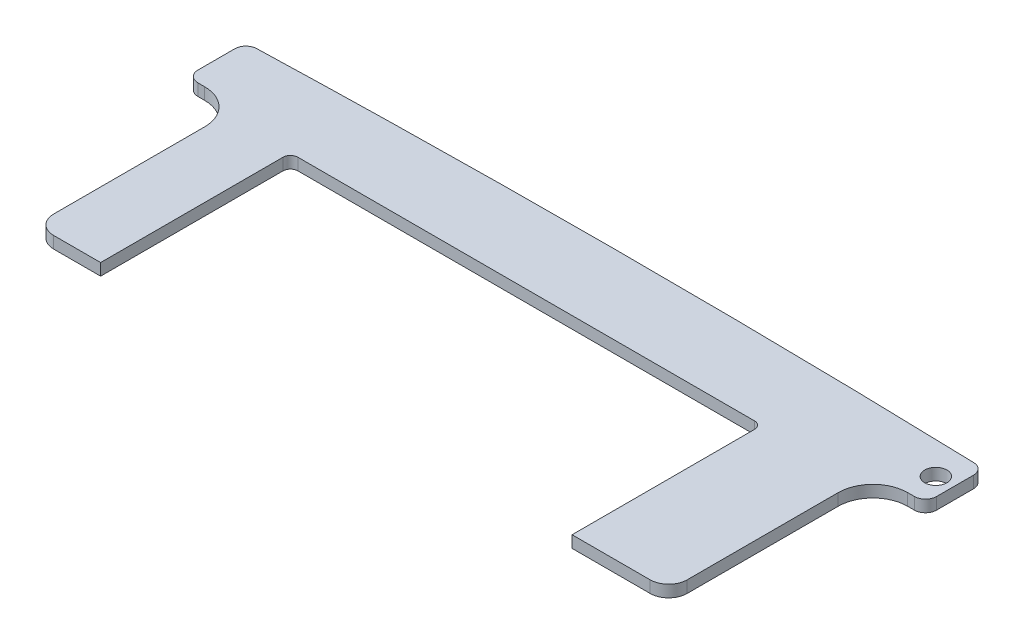
ISO-10303-21;
HEADER;
FILE_DESCRIPTION(('STEP AP214'),'2;1');
FILE_NAME('part.step','',(''),(''),'','','');
FILE_SCHEMA(('AUTOMOTIVE_DESIGN { 1 0 10303 214 1 1 1 1 }'));
ENDSEC;
DATA;
#1=APPLICATION_CONTEXT('core data for automotive mechanical design processes');
#2=APPLICATION_PROTOCOL_DEFINITION('international standard','automotive_design',2000,#1);
#3=PRODUCT_CONTEXT('',#1,'mechanical');
#4=PRODUCT('Part','Part','',(#3));
#5=PRODUCT_RELATED_PRODUCT_CATEGORY('part','',(#4));
#6=PRODUCT_DEFINITION_FORMATION('','',#4);
#7=PRODUCT_DEFINITION_CONTEXT('part definition',#1,'design');
#8=PRODUCT_DEFINITION('design','',#6,#7);
#9=PRODUCT_DEFINITION_SHAPE('','',#8);
#10=(LENGTH_UNIT() NAMED_UNIT(*) SI_UNIT(.MILLI.,.METRE.));
#11=(NAMED_UNIT(*) PLANE_ANGLE_UNIT() SI_UNIT($,.RADIAN.));
#12=(NAMED_UNIT(*) SI_UNIT($,.STERADIAN.) SOLID_ANGLE_UNIT());
#13=UNCERTAINTY_MEASURE_WITH_UNIT(LENGTH_MEASURE(1.E-05),#10,'distance_accuracy_value','');
#14=(GEOMETRIC_REPRESENTATION_CONTEXT(3) GLOBAL_UNCERTAINTY_ASSIGNED_CONTEXT((#13)) GLOBAL_UNIT_ASSIGNED_CONTEXT((#10,
#11,#12)) REPRESENTATION_CONTEXT('',''));
#15=CARTESIAN_POINT('',(0.,0.,0.));
#16=DIRECTION('',(0.,0.,1.));
#17=DIRECTION('',(1.,0.,0.));
#18=AXIS2_PLACEMENT_3D('',#15,#16,#17);
#19=CARTESIAN_POINT('',(0.899999999999838,1.6,2.30000000000011));
#20=DIRECTION('',(0.,-1.,0.));
#21=DIRECTION('',(0.,0.,-1.));
#22=AXIS2_PLACEMENT_3D('',#19,#20,#21);
#23=CYLINDRICAL_SURFACE('',#22,1.5);
#24=CARTESIAN_POINT('',(0.899999999999838,0.,2.30000000000011));
#25=DIRECTION('',(0.,1.,0.));
#26=DIRECTION('',(0.,0.,1.));
#27=AXIS2_PLACEMENT_3D('',#24,#25,#26);
#28=CIRCLE('',#27,1.5);
#29=CARTESIAN_POINT('',(0.899999999999838,0.,3.80000000000011));
#30=VERTEX_POINT('',#29);
#31=CARTESIAN_POINT('',(2.39999999999984,0.,2.30000000000011));
#32=VERTEX_POINT('',#31);
#33=EDGE_CURVE('E206',#30,#32,#28,.T.);
#34=ORIENTED_EDGE('',*,*,#33,.T.);
#35=DIRECTION('',(0.,-1.,0.));
#36=VECTOR('',#35,1.);
#37=CARTESIAN_POINT('',(2.39999999999984,1.6,2.30000000000011));
#38=LINE('',#37,#36);
#39=CARTESIAN_POINT('',(2.39999999999984,1.6,2.30000000000011));
#40=VERTEX_POINT('',#39);
#41=EDGE_CURVE('E186',#40,#32,#38,.T.);
#42=ORIENTED_EDGE('',*,*,#41,.F.);
#43=CARTESIAN_POINT('',(0.899999999999838,1.6,2.30000000000011));
#44=DIRECTION('',(0.,1.,0.));
#45=DIRECTION('',(0.,0.,1.));
#46=AXIS2_PLACEMENT_3D('',#43,#44,#45);
#47=CIRCLE('',#46,1.5);
#48=CARTESIAN_POINT('',(0.899999999999838,1.6,3.80000000000011));
#49=VERTEX_POINT('',#48);
#50=EDGE_CURVE('E193',#49,#40,#47,.T.);
#51=ORIENTED_EDGE('',*,*,#50,.F.);
#52=DIRECTION('',(0.,-1.,0.));
#53=VECTOR('',#52,1.);
#54=CARTESIAN_POINT('',(0.899999999999838,1.6,3.80000000000011));
#55=LINE('',#54,#53);
#56=EDGE_CURVE('E276',#49,#30,#55,.T.);
#57=ORIENTED_EDGE('',*,*,#56,.T.);
#58=EDGE_LOOP('',(#34,#42,#51,#57));
#59=FACE_BOUND('',#58,.T.);
#60=ADVANCED_FACE('F35',(#59),#23,.T.);
#61=CARTESIAN_POINT('',(2.39999999999984,1.6,0.));
#62=DIRECTION('',(-1.,0.,0.));
#63=DIRECTION('',(0.,0.,1.));
#64=AXIS2_PLACEMENT_3D('',#61,#62,#63);
#65=PLANE('',#64);
#66=DIRECTION('',(0.,0.,-1.));
#67=VECTOR('',#66,1.);
#68=CARTESIAN_POINT('',(2.39999999999984,0.,0.));
#69=LINE('',#68,#67);
#70=CARTESIAN_POINT('',(2.39999999999984,0.,-2.67635027045199));
#71=VERTEX_POINT('',#70);
#72=EDGE_CURVE('E326',#32,#71,#69,.T.);
#73=ORIENTED_EDGE('',*,*,#72,.T.);
#74=DIRECTION('',(0.,-1.,0.));
#75=VECTOR('',#74,1.);
#76=CARTESIAN_POINT('',(2.39999999999984,1.6,-2.67635027045199));
#77=LINE('',#76,#75);
#78=CARTESIAN_POINT('',(2.39999999999984,1.6,-2.67635027045199));
#79=VERTEX_POINT('',#78);
#80=EDGE_CURVE('E189',#79,#71,#77,.T.);
#81=ORIENTED_EDGE('',*,*,#80,.F.);
#82=DIRECTION('',(0.,0.,-1.));
#83=VECTOR('',#82,1.);
#84=CARTESIAN_POINT('',(2.39999999999984,1.6,0.));
#85=LINE('',#84,#83);
#86=EDGE_CURVE('E182',#40,#79,#85,.T.);
#87=ORIENTED_EDGE('',*,*,#86,.F.);
#88=ORIENTED_EDGE('',*,*,#41,.T.);
#89=EDGE_LOOP('',(#73,#81,#87,#88));
#90=FACE_BOUND('',#89,.T.);
#91=ADVANCED_FACE('F184',(#90),#65,.F.);
#92=CARTESIAN_POINT('',(0.899999999999838,1.6,-2.67635027045199));
#93=DIRECTION('',(0.,-1.,0.));
#94=DIRECTION('',(0.,0.,-1.));
#95=AXIS2_PLACEMENT_3D('',#92,#93,#94);
#96=CYLINDRICAL_SURFACE('',#95,1.5);
#97=CARTESIAN_POINT('',(0.899999999999838,0.,-2.67635027045199));
#98=DIRECTION('',(0.,1.,0.));
#99=DIRECTION('',(0.,0.,1.));
#100=AXIS2_PLACEMENT_3D('',#97,#98,#99);
#101=CIRCLE('',#100,1.5);
#102=CARTESIAN_POINT('',(0.945019779821518,0.,-4.17567452471616));
#103=VERTEX_POINT('',#102);
#104=EDGE_CURVE('E319',#71,#103,#101,.T.);
#105=ORIENTED_EDGE('',*,*,#104,.T.);
#106=DIRECTION('',(0.,-1.,0.));
#107=VECTOR('',#106,1.);
#108=CARTESIAN_POINT('',(0.945019779821518,1.6,-4.17567452471616));
#109=LINE('',#108,#107);
#110=CARTESIAN_POINT('',(0.945019779821518,1.6,-4.17567452471616));
#111=VERTEX_POINT('',#110);
#112=EDGE_CURVE('E212',#111,#103,#109,.T.);
#113=ORIENTED_EDGE('',*,*,#112,.F.);
#114=CARTESIAN_POINT('',(0.899999999999838,1.6,-2.67635027045199));
#115=DIRECTION('',(0.,1.,0.));
#116=DIRECTION('',(0.,0.,1.));
#117=AXIS2_PLACEMENT_3D('',#114,#115,#116);
#118=CIRCLE('',#117,1.5);
#119=EDGE_CURVE('E192',#79,#111,#118,.T.);
#120=ORIENTED_EDGE('',*,*,#119,.F.);
#121=ORIENTED_EDGE('',*,*,#80,.T.);
#122=EDGE_LOOP('',(#105,#113,#120,#121));
#123=FACE_BOUND('',#122,.T.);
#124=ADVANCED_FACE('F421',(#123),#96,.T.);
#125=CARTESIAN_POINT('',(-47.5000000000002,1.6,49.6315409627609));
#126=DIRECTION('',(0.,1.,0.));
#127=DIRECTION('',(-1.,0.,0.));
#128=AXIS2_PLACEMENT_3D('',#125,#126,#127);
#129=ELLIPSE('',#128,298.595610235777,54.5296875190183);
#130=DIRECTION('',(0.,-1.,0.));
#131=VECTOR('',#130,1.);
#132=SURFACE_OF_LINEAR_EXTRUSION('',#129,#131);
#133=CARTESIAN_POINT('',(-47.5000000000002,0.,49.6315409627609));
#134=DIRECTION('',(0.,1.,0.));
#135=DIRECTION('',(-1.,0.,0.));
#136=AXIS2_PLACEMENT_3D('',#133,#134,#135);
#137=ELLIPSE('',#136,298.595610235777,54.5296875190183);
#138=CARTESIAN_POINT('',(-95.9450197798218,0.,-4.17567452471616));
#139=VERTEX_POINT('',#138);
#140=EDGE_CURVE('E314',#103,#139,#137,.T.);
#141=ORIENTED_EDGE('',*,*,#140,.T.);
#142=DIRECTION('',(0.,-1.,0.));
#143=VECTOR('',#142,1.);
#144=CARTESIAN_POINT('',(-95.9450197798218,1.6,-4.17567452471616));
#145=LINE('',#144,#143);
#146=CARTESIAN_POINT('',(-95.9450197798218,1.6,-4.17567452471616));
#147=VERTEX_POINT('',#146);
#148=EDGE_CURVE('E305',#147,#139,#145,.T.);
#149=ORIENTED_EDGE('',*,*,#148,.F.);
#150=EDGE_CURVE('E316',#111,#147,#129,.T.);
#151=ORIENTED_EDGE('',*,*,#150,.F.);
#152=ORIENTED_EDGE('',*,*,#112,.T.);
#153=EDGE_LOOP('',(#141,#149,#151,#152));
#154=FACE_BOUND('',#153,.T.);
#155=ADVANCED_FACE('F312',(#154),#132,.F.);
#156=CARTESIAN_POINT('',(-95.9000000000001,1.6,-2.67635027045199));
#157=DIRECTION('',(0.,-1.,0.));
#158=DIRECTION('',(0.,0.,-1.));
#159=AXIS2_PLACEMENT_3D('',#156,#157,#158);
#160=CYLINDRICAL_SURFACE('',#159,1.5);
#161=CARTESIAN_POINT('',(-95.9000000000001,0.,-2.67635027045199));
#162=DIRECTION('',(0.,1.,0.));
#163=DIRECTION('',(0.,0.,1.));
#164=AXIS2_PLACEMENT_3D('',#161,#162,#163);
#165=CIRCLE('',#164,1.5);
#166=CARTESIAN_POINT('',(-97.4000000000001,0.,-2.67635027045199));
#167=VERTEX_POINT('',#166);
#168=EDGE_CURVE('E322',#167,#139,#165,.F.);
#169=ORIENTED_EDGE('',*,*,#168,.F.);
#170=DIRECTION('',(0.,-1.,0.));
#171=VECTOR('',#170,1.);
#172=CARTESIAN_POINT('',(-97.4000000000001,1.6,-2.67635027045199));
#173=LINE('',#172,#171);
#174=CARTESIAN_POINT('',(-97.4000000000001,1.6,-2.67635027045199));
#175=VERTEX_POINT('',#174);
#176=EDGE_CURVE('E303',#175,#167,#173,.T.);
#177=ORIENTED_EDGE('',*,*,#176,.F.);
#178=CARTESIAN_POINT('',(-95.9000000000001,1.6,-2.67635027045199));
#179=DIRECTION('',(0.,1.,0.));
#180=DIRECTION('',(0.,0.,1.));
#181=AXIS2_PLACEMENT_3D('',#178,#179,#180);
#182=CIRCLE('',#181,1.5);
#183=EDGE_CURVE('E389',#175,#147,#182,.F.);
#184=ORIENTED_EDGE('',*,*,#183,.T.);
#185=ORIENTED_EDGE('',*,*,#148,.T.);
#186=EDGE_LOOP('',(#169,#177,#184,#185));
#187=FACE_BOUND('',#186,.T.);
#188=ADVANCED_FACE('F385',(#187),#160,.T.);
#189=CARTESIAN_POINT('',(-97.4000000000001,1.6,0.));
#190=DIRECTION('',(1.,0.,0.));
#191=DIRECTION('',(0.,0.,-1.));
#192=AXIS2_PLACEMENT_3D('',#189,#190,#191);
#193=PLANE('',#192);
#194=DIRECTION('',(0.,0.,1.));
#195=VECTOR('',#194,1.);
#196=CARTESIAN_POINT('',(-97.4000000000001,0.,0.));
#197=LINE('',#196,#195);
#198=CARTESIAN_POINT('',(-97.4000000000001,0.,2.30000000000011));
#199=VERTEX_POINT('',#198);
#200=EDGE_CURVE('E324',#167,#199,#197,.T.);
#201=ORIENTED_EDGE('',*,*,#200,.T.);
#202=DIRECTION('',(0.,-1.,0.));
#203=VECTOR('',#202,1.);
#204=CARTESIAN_POINT('',(-97.4000000000001,1.6,2.30000000000011));
#205=LINE('',#204,#203);
#206=CARTESIAN_POINT('',(-97.4000000000001,1.6,2.30000000000011));
#207=VERTEX_POINT('',#206);
#208=EDGE_CURVE('E301',#207,#199,#205,.T.);
#209=ORIENTED_EDGE('',*,*,#208,.F.);
#210=DIRECTION('',(0.,0.,1.));
#211=VECTOR('',#210,1.);
#212=CARTESIAN_POINT('',(-97.4000000000001,1.6,0.));
#213=LINE('',#212,#211);
#214=EDGE_CURVE('E390',#175,#207,#213,.T.);
#215=ORIENTED_EDGE('',*,*,#214,.F.);
#216=ORIENTED_EDGE('',*,*,#176,.T.);
#217=EDGE_LOOP('',(#201,#209,#215,#216));
#218=FACE_BOUND('',#217,.T.);
#219=ADVANCED_FACE('F489',(#218),#193,.F.);
#220=CARTESIAN_POINT('',(-95.9000000000001,1.6,2.30000000000011));
#221=DIRECTION('',(0.,-1.,0.));
#222=DIRECTION('',(0.,0.,-1.));
#223=AXIS2_PLACEMENT_3D('',#220,#221,#222);
#224=CYLINDRICAL_SURFACE('',#223,1.5);
#225=CARTESIAN_POINT('',(-95.9000000000001,0.,2.30000000000011));
#226=DIRECTION('',(0.,1.,0.));
#227=DIRECTION('',(0.,0.,1.));
#228=AXIS2_PLACEMENT_3D('',#225,#226,#227);
#229=CIRCLE('',#228,1.5);
#230=CARTESIAN_POINT('',(-95.9000000000001,0.,3.80000000000011));
#231=VERTEX_POINT('',#230);
#232=EDGE_CURVE('E332',#231,#199,#229,.F.);
#233=ORIENTED_EDGE('',*,*,#232,.F.);
#234=DIRECTION('',(0.,-1.,0.));
#235=VECTOR('',#234,1.);
#236=CARTESIAN_POINT('',(-95.9000000000001,1.6,3.80000000000011));
#237=LINE('',#236,#235);
#238=CARTESIAN_POINT('',(-95.9000000000001,1.6,3.80000000000011));
#239=VERTEX_POINT('',#238);
#240=EDGE_CURVE('E299',#239,#231,#237,.T.);
#241=ORIENTED_EDGE('',*,*,#240,.F.);
#242=CARTESIAN_POINT('',(-95.9000000000001,1.6,2.30000000000011));
#243=DIRECTION('',(0.,1.,0.));
#244=DIRECTION('',(0.,0.,1.));
#245=AXIS2_PLACEMENT_3D('',#242,#243,#244);
#246=CIRCLE('',#245,1.5);
#247=EDGE_CURVE('E392',#239,#207,#246,.F.);
#248=ORIENTED_EDGE('',*,*,#247,.T.);
#249=ORIENTED_EDGE('',*,*,#208,.T.);
#250=EDGE_LOOP('',(#233,#241,#248,#249));
#251=FACE_BOUND('',#250,.T.);
#252=ADVANCED_FACE('F381',(#251),#224,.T.);
#253=CARTESIAN_POINT('',(0.,1.6,3.80000000000007));
#254=DIRECTION('',(0.,0.,1.));
#255=DIRECTION('',(1.,0.,0.));
#256=AXIS2_PLACEMENT_3D('',#253,#254,#255);
#257=PLANE('',#256);
#258=DIRECTION('',(-1.,0.,0.));
#259=VECTOR('',#258,1.);
#260=CARTESIAN_POINT('',(0.,0.,3.80000000000007));
#261=LINE('',#260,#259);
#262=CARTESIAN_POINT('',(-94.9999999999981,0.,3.80000000000011));
#263=VERTEX_POINT('',#262);
#264=EDGE_CURVE('E335',#263,#231,#261,.T.);
#265=ORIENTED_EDGE('',*,*,#264,.F.);
#266=DIRECTION('',(0.,-1.,0.));
#267=VECTOR('',#266,1.);
#268=CARTESIAN_POINT('',(-94.9999999999981,1.6,3.80000000000011));
#269=LINE('',#268,#267);
#270=CARTESIAN_POINT('',(-94.9999999999981,1.6,3.80000000000011));
#271=VERTEX_POINT('',#270);
#272=EDGE_CURVE('E297',#271,#263,#269,.T.);
#273=ORIENTED_EDGE('',*,*,#272,.F.);
#274=DIRECTION('',(-1.,0.,0.));
#275=VECTOR('',#274,1.);
#276=CARTESIAN_POINT('',(0.,1.6,3.80000000000007));
#277=LINE('',#276,#275);
#278=EDGE_CURVE('E377',#271,#239,#277,.T.);
#279=ORIENTED_EDGE('',*,*,#278,.T.);
#280=ORIENTED_EDGE('',*,*,#240,.T.);
#281=EDGE_LOOP('',(#265,#273,#279,#280));
#282=FACE_BOUND('',#281,.T.);
#283=ADVANCED_FACE('F375',(#282),#257,.T.);
#284=CARTESIAN_POINT('',(-94.9999999999981,1.6,8.5000000000001));
#285=DIRECTION('',(0.,-1.,0.));
#286=DIRECTION('',(0.,0.,-1.));
#287=AXIS2_PLACEMENT_3D('',#284,#285,#286);
#288=CYLINDRICAL_SURFACE('',#287,4.70000000000003);
#289=CARTESIAN_POINT('',(-94.9999999999981,0.,8.5000000000001));
#290=DIRECTION('',(0.,1.,0.));
#291=DIRECTION('',(0.,0.,1.));
#292=AXIS2_PLACEMENT_3D('',#289,#290,#291);
#293=CIRCLE('',#292,4.70000000000003);
#294=CARTESIAN_POINT('',(-90.299999999998,0.,8.5000000000001));
#295=VERTEX_POINT('',#294);
#296=EDGE_CURVE('E338',#295,#263,#293,.T.);
#297=ORIENTED_EDGE('',*,*,#296,.F.);
#298=DIRECTION('',(0.,-1.,0.));
#299=VECTOR('',#298,1.);
#300=CARTESIAN_POINT('',(-90.299999999998,1.6,8.5000000000001));
#301=LINE('',#300,#299);
#302=CARTESIAN_POINT('',(-90.299999999998,1.6,8.5000000000001));
#303=VERTEX_POINT('',#302);
#304=EDGE_CURVE('E295',#303,#295,#301,.T.);
#305=ORIENTED_EDGE('',*,*,#304,.F.);
#306=CARTESIAN_POINT('',(-94.9999999999981,1.6,8.5000000000001));
#307=DIRECTION('',(0.,1.,0.));
#308=DIRECTION('',(0.,0.,1.));
#309=AXIS2_PLACEMENT_3D('',#306,#307,#308);
#310=CIRCLE('',#309,4.70000000000003);
#311=EDGE_CURVE('E371',#303,#271,#310,.T.);
#312=ORIENTED_EDGE('',*,*,#311,.T.);
#313=ORIENTED_EDGE('',*,*,#272,.T.);
#314=EDGE_LOOP('',(#297,#305,#312,#313));
#315=FACE_BOUND('',#314,.T.);
#316=ADVANCED_FACE('F368',(#315),#288,.F.);
#317=CARTESIAN_POINT('',(-90.299999999998,1.6,0.));
#318=DIRECTION('',(-1.,0.,0.));
#319=DIRECTION('',(0.,0.,1.));
#320=AXIS2_PLACEMENT_3D('',#317,#318,#319);
#321=PLANE('',#320);
#322=DIRECTION('',(0.,0.,-1.));
#323=VECTOR('',#322,1.);
#324=CARTESIAN_POINT('',(-90.299999999998,0.,0.));
#325=LINE('',#324,#323);
#326=CARTESIAN_POINT('',(-90.299999999998,0.,28.9018534437427));
#327=VERTEX_POINT('',#326);
#328=EDGE_CURVE('E341',#327,#295,#325,.T.);
#329=ORIENTED_EDGE('',*,*,#328,.F.);
#330=DIRECTION('',(0.,-1.,0.));
#331=VECTOR('',#330,1.);
#332=CARTESIAN_POINT('',(-90.299999999998,1.6,28.9018534437427));
#333=LINE('',#332,#331);
#334=CARTESIAN_POINT('',(-90.299999999998,1.6,28.9018534437427));
#335=VERTEX_POINT('',#334);
#336=EDGE_CURVE('E293',#335,#327,#333,.T.);
#337=ORIENTED_EDGE('',*,*,#336,.F.);
#338=DIRECTION('',(0.,0.,-1.));
#339=VECTOR('',#338,1.);
#340=CARTESIAN_POINT('',(-90.299999999998,1.6,0.));
#341=LINE('',#340,#339);
#342=EDGE_CURVE('E401',#335,#303,#341,.T.);
#343=ORIENTED_EDGE('',*,*,#342,.T.);
#344=ORIENTED_EDGE('',*,*,#304,.T.);
#345=EDGE_LOOP('',(#329,#337,#343,#344));
#346=FACE_BOUND('',#345,.T.);
#347=ADVANCED_FACE('F364',(#346),#321,.T.);
#348=CARTESIAN_POINT('',(-87.799999999998,1.6,28.9018534437427));
#349=DIRECTION('',(0.,-1.,0.));
#350=DIRECTION('',(0.,0.,-1.));
#351=AXIS2_PLACEMENT_3D('',#348,#349,#350);
#352=CYLINDRICAL_SURFACE('',#351,2.49999999999999);
#353=CARTESIAN_POINT('',(-87.799999999998,0.,28.9018534437427));
#354=DIRECTION('',(0.,1.,0.));
#355=DIRECTION('',(0.,0.,1.));
#356=AXIS2_PLACEMENT_3D('',#353,#354,#355);
#357=CIRCLE('',#356,2.49999999999999);
#358=CARTESIAN_POINT('',(-87.799999999998,0.,31.4018534437427));
#359=VERTEX_POINT('',#358);
#360=EDGE_CURVE('E344',#359,#327,#357,.F.);
#361=ORIENTED_EDGE('',*,*,#360,.F.);
#362=DIRECTION('',(0.,-1.,0.));
#363=VECTOR('',#362,1.);
#364=CARTESIAN_POINT('',(-87.799999999998,1.6,31.4018534437427));
#365=LINE('',#364,#363);
#366=CARTESIAN_POINT('',(-87.799999999998,1.6,31.4018534437427));
#367=VERTEX_POINT('',#366);
#368=EDGE_CURVE('E291',#367,#359,#365,.T.);
#369=ORIENTED_EDGE('',*,*,#368,.F.);
#370=CARTESIAN_POINT('',(-87.799999999998,1.6,28.9018534437427));
#371=DIRECTION('',(0.,1.,0.));
#372=DIRECTION('',(0.,0.,1.));
#373=AXIS2_PLACEMENT_3D('',#370,#371,#372);
#374=CIRCLE('',#373,2.49999999999999);
#375=EDGE_CURVE('E360',#367,#335,#374,.F.);
#376=ORIENTED_EDGE('',*,*,#375,.T.);
#377=ORIENTED_EDGE('',*,*,#336,.T.);
#378=EDGE_LOOP('',(#361,#369,#376,#377));
#379=FACE_BOUND('',#378,.T.);
#380=ADVANCED_FACE('F358',(#379),#352,.T.);
#381=CARTESIAN_POINT('',(0.,1.6,31.4018534437426));
#382=DIRECTION('',(0.,0.,1.));
#383=DIRECTION('',(1.,0.,0.));
#384=AXIS2_PLACEMENT_3D('',#381,#382,#383);
#385=PLANE('',#384);
#386=DIRECTION('',(-1.,0.,0.));
#387=VECTOR('',#386,1.);
#388=CARTESIAN_POINT('',(0.,0.,31.4018534437426));
#389=LINE('',#388,#387);
#390=CARTESIAN_POINT('',(-81.4499999999987,0.,31.4018534437426));
#391=VERTEX_POINT('',#390);
#392=EDGE_CURVE('E257',#391,#359,#389,.T.);
#393=ORIENTED_EDGE('',*,*,#392,.F.);
#394=DIRECTION('',(0.,-1.,0.));
#395=VECTOR('',#394,1.);
#396=CARTESIAN_POINT('',(-81.4499999999987,1.6,31.4018534437426));
#397=LINE('',#396,#395);
#398=CARTESIAN_POINT('',(-81.4499999999987,1.6,31.4018534437426));
#399=VERTEX_POINT('',#398);
#400=EDGE_CURVE('E288',#399,#391,#397,.T.);
#401=ORIENTED_EDGE('',*,*,#400,.F.);
#402=DIRECTION('',(-1.,0.,0.));
#403=VECTOR('',#402,1.);
#404=CARTESIAN_POINT('',(0.,1.6,31.4018534437426));
#405=LINE('',#404,#403);
#406=EDGE_CURVE('E354',#399,#367,#405,.T.);
#407=ORIENTED_EDGE('',*,*,#406,.T.);
#408=ORIENTED_EDGE('',*,*,#368,.T.);
#409=EDGE_LOOP('',(#393,#401,#407,#408));
#410=FACE_BOUND('',#409,.T.);
#411=ADVANCED_FACE('F351',(#410),#385,.T.);
#412=CARTESIAN_POINT('',(-81.4499999999988,1.6,0.));
#413=DIRECTION('',(1.,0.,0.));
#414=DIRECTION('',(0.,0.,-1.));
#415=AXIS2_PLACEMENT_3D('',#412,#413,#414);
#416=PLANE('',#415);
#417=DIRECTION('',(0.,0.,1.));
#418=VECTOR('',#417,1.);
#419=CARTESIAN_POINT('',(-81.4499999999988,0.,0.));
#420=LINE('',#419,#418);
#421=CARTESIAN_POINT('',(-81.4499999999988,0.,6.75185344374261));
#422=VERTEX_POINT('',#421);
#423=EDGE_CURVE('E253',#422,#391,#420,.T.);
#424=ORIENTED_EDGE('',*,*,#423,.F.);
#425=DIRECTION('',(0.,-1.,0.));
#426=VECTOR('',#425,1.);
#427=CARTESIAN_POINT('',(-81.4499999999988,1.6,6.75185344374261));
#428=LINE('',#427,#426);
#429=CARTESIAN_POINT('',(-81.4499999999988,1.6,6.75185344374261));
#430=VERTEX_POINT('',#429);
#431=EDGE_CURVE('E50',#422,#430,#428,.F.);
#432=ORIENTED_EDGE('',*,*,#431,.T.);
#433=DIRECTION('',(0.,0.,1.));
#434=VECTOR('',#433,1.);
#435=CARTESIAN_POINT('',(-81.4499999999988,1.6,0.));
#436=LINE('',#435,#434);
#437=EDGE_CURVE('E405',#430,#399,#436,.T.);
#438=ORIENTED_EDGE('',*,*,#437,.T.);
#439=ORIENTED_EDGE('',*,*,#400,.T.);
#440=EDGE_LOOP('',(#424,#432,#438,#439));
#441=FACE_BOUND('',#440,.T.);
#442=ADVANCED_FACE('F474',(#441),#416,.T.);
#443=CARTESIAN_POINT('',(0.,1.6,5.75185344374258));
#444=DIRECTION('',(0.,0.,1.));
#445=DIRECTION('',(1.,0.,0.));
#446=AXIS2_PLACEMENT_3D('',#443,#444,#445);
#447=PLANE('',#446);
#448=DIRECTION('',(-1.,0.,0.));
#449=VECTOR('',#448,1.);
#450=CARTESIAN_POINT('',(0.,0.,5.75185344374258));
#451=LINE('',#450,#449);
#452=CARTESIAN_POINT('',(-18.7499999999987,0.,5.75185344374259));
#453=VERTEX_POINT('',#452);
#454=CARTESIAN_POINT('',(-80.4499999999987,0.,5.75185344374261));
#455=VERTEX_POINT('',#454);
#456=EDGE_CURVE('E247',#453,#455,#451,.T.);
#457=ORIENTED_EDGE('',*,*,#456,.F.);
#458=DIRECTION('',(0.,-1.,0.));
#459=VECTOR('',#458,1.);
#460=CARTESIAN_POINT('',(-18.7499999999987,1.6,5.75185344374259));
#461=LINE('',#460,#459);
#462=CARTESIAN_POINT('',(-18.7499999999987,1.6,5.75185344374259));
#463=VERTEX_POINT('',#462);
#464=EDGE_CURVE('E218',#453,#463,#461,.F.);
#465=ORIENTED_EDGE('',*,*,#464,.T.);
#466=DIRECTION('',(-1.,0.,0.));
#467=VECTOR('',#466,1.);
#468=CARTESIAN_POINT('',(0.,1.6,5.75185344374258));
#469=LINE('',#468,#467);
#470=CARTESIAN_POINT('',(-80.4499999999987,1.6,5.75185344374261));
#471=VERTEX_POINT('',#470);
#472=EDGE_CURVE('E232',#463,#471,#469,.T.);
#473=ORIENTED_EDGE('',*,*,#472,.T.);
#474=DIRECTION('',(0.,-1.,0.));
#475=VECTOR('',#474,1.);
#476=CARTESIAN_POINT('',(-80.4499999999987,0.,5.75185344374261));
#477=LINE('',#476,#475);
#478=EDGE_CURVE('E210',#471,#455,#477,.T.);
#479=ORIENTED_EDGE('',*,*,#478,.T.);
#480=EDGE_LOOP('',(#457,#465,#473,#479));
#481=FACE_BOUND('',#480,.T.);
#482=ADVANCED_FACE('F251',(#481),#447,.T.);
#483=CARTESIAN_POINT('',(-17.7499999999987,1.6,0.));
#484=DIRECTION('',(-1.,0.,0.));
#485=DIRECTION('',(0.,0.,1.));
#486=AXIS2_PLACEMENT_3D('',#483,#484,#485);
#487=PLANE('',#486);
#488=DIRECTION('',(0.,0.,-1.));
#489=VECTOR('',#488,1.);
#490=CARTESIAN_POINT('',(-17.7499999999987,1.6,0.));
#491=LINE('',#490,#489);
#492=CARTESIAN_POINT('',(-17.7499999999987,1.6,31.4018534437427));
#493=VERTEX_POINT('',#492);
#494=CARTESIAN_POINT('',(-17.7499999999987,1.6,6.75185344374259));
#495=VERTEX_POINT('',#494);
#496=EDGE_CURVE('E229',#493,#495,#491,.T.);
#497=ORIENTED_EDGE('',*,*,#496,.T.);
#498=DIRECTION('',(0.,-1.,0.));
#499=VECTOR('',#498,1.);
#500=CARTESIAN_POINT('',(-17.7499999999987,0.,6.75185344374259));
#501=LINE('',#500,#499);
#502=CARTESIAN_POINT('',(-17.7499999999987,0.,6.75185344374259));
#503=VERTEX_POINT('',#502);
#504=EDGE_CURVE('E207',#495,#503,#501,.T.);
#505=ORIENTED_EDGE('',*,*,#504,.T.);
#506=DIRECTION('',(0.,0.,-1.));
#507=VECTOR('',#506,1.);
#508=CARTESIAN_POINT('',(-17.7499999999987,0.,0.));
#509=LINE('',#508,#507);
#510=CARTESIAN_POINT('',(-17.7499999999987,0.,31.4018534437427));
#511=VERTEX_POINT('',#510);
#512=EDGE_CURVE('E249',#511,#503,#509,.T.);
#513=ORIENTED_EDGE('',*,*,#512,.F.);
#514=DIRECTION('',(0.,-1.,0.));
#515=VECTOR('',#514,1.);
#516=CARTESIAN_POINT('',(-17.7499999999987,1.6,31.4018534437427));
#517=LINE('',#516,#515);
#518=EDGE_CURVE('E240',#493,#511,#517,.T.);
#519=ORIENTED_EDGE('',*,*,#518,.F.);
#520=EDGE_LOOP('',(#497,#505,#513,#519));
#521=FACE_BOUND('',#520,.T.);
#522=ADVANCED_FACE('F237',(#521),#487,.T.);
#523=CARTESIAN_POINT('',(0.,1.6,31.4018534437427));
#524=DIRECTION('',(0.,0.,1.));
#525=DIRECTION('',(1.,0.,0.));
#526=AXIS2_PLACEMENT_3D('',#523,#524,#525);
#527=PLANE('',#526);
#528=DIRECTION('',(-1.,0.,0.));
#529=VECTOR('',#528,1.);
#530=CARTESIAN_POINT('',(0.,0.,31.4018534437427));
#531=LINE('',#530,#529);
#532=CARTESIAN_POINT('',(-7.19999999999822,0.,31.4018534437427));
#533=VERTEX_POINT('',#532);
#534=EDGE_CURVE('E255',#533,#511,#531,.T.);
#535=ORIENTED_EDGE('',*,*,#534,.F.);
#536=DIRECTION('',(0.,-1.,0.));
#537=VECTOR('',#536,1.);
#538=CARTESIAN_POINT('',(-7.19999999999822,1.6,31.4018534437427));
#539=LINE('',#538,#537);
#540=CARTESIAN_POINT('',(-7.19999999999822,1.6,31.4018534437427));
#541=VERTEX_POINT('',#540);
#542=EDGE_CURVE('E285',#541,#533,#539,.T.);
#543=ORIENTED_EDGE('',*,*,#542,.F.);
#544=DIRECTION('',(-1.,0.,0.));
#545=VECTOR('',#544,1.);
#546=CARTESIAN_POINT('',(0.,1.6,31.4018534437427));
#547=LINE('',#546,#545);
#548=EDGE_CURVE('E241',#541,#493,#547,.T.);
#549=ORIENTED_EDGE('',*,*,#548,.T.);
#550=ORIENTED_EDGE('',*,*,#518,.T.);
#551=EDGE_LOOP('',(#535,#543,#549,#550));
#552=FACE_BOUND('',#551,.T.);
#553=ADVANCED_FACE('F465',(#552),#527,.T.);
#554=CARTESIAN_POINT('',(-7.19999999999822,1.6,28.9018534437427));
#555=DIRECTION('',(0.,-1.,0.));
#556=DIRECTION('',(0.,0.,-1.));
#557=AXIS2_PLACEMENT_3D('',#554,#555,#556);
#558=CYLINDRICAL_SURFACE('',#557,2.5);
#559=CARTESIAN_POINT('',(-7.19999999999822,0.,28.9018534437427));
#560=DIRECTION('',(0.,1.,0.));
#561=DIRECTION('',(0.,0.,1.));
#562=AXIS2_PLACEMENT_3D('',#559,#560,#561);
#563=CIRCLE('',#562,2.5);
#564=CARTESIAN_POINT('',(-4.69999999999822,0.,28.9018534437427));
#565=VERTEX_POINT('',#564);
#566=EDGE_CURVE('E262',#565,#533,#563,.F.);
#567=ORIENTED_EDGE('',*,*,#566,.F.);
#568=DIRECTION('',(0.,-1.,0.));
#569=VECTOR('',#568,1.);
#570=CARTESIAN_POINT('',(-4.69999999999822,1.6,28.9018534437427));
#571=LINE('',#570,#569);
#572=CARTESIAN_POINT('',(-4.69999999999822,1.6,28.9018534437427));
#573=VERTEX_POINT('',#572);
#574=EDGE_CURVE('E283',#573,#565,#571,.T.);
#575=ORIENTED_EDGE('',*,*,#574,.F.);
#576=CARTESIAN_POINT('',(-7.19999999999822,1.6,28.9018534437427));
#577=DIRECTION('',(0.,1.,0.));
#578=DIRECTION('',(0.,0.,1.));
#579=AXIS2_PLACEMENT_3D('',#576,#577,#578);
#580=CIRCLE('',#579,2.5);
#581=EDGE_CURVE('E409',#573,#541,#580,.F.);
#582=ORIENTED_EDGE('',*,*,#581,.T.);
#583=ORIENTED_EDGE('',*,*,#542,.T.);
#584=EDGE_LOOP('',(#567,#575,#582,#583));
#585=FACE_BOUND('',#584,.T.);
#586=ADVANCED_FACE('F461',(#585),#558,.T.);
#587=CARTESIAN_POINT('',(-4.69999999999822,1.6,0.));
#588=DIRECTION('',(1.,0.,0.));
#589=DIRECTION('',(0.,0.,-1.));
#590=AXIS2_PLACEMENT_3D('',#587,#588,#589);
#591=PLANE('',#590);
#592=DIRECTION('',(0.,0.,1.));
#593=VECTOR('',#592,1.);
#594=CARTESIAN_POINT('',(-4.69999999999822,0.,0.));
#595=LINE('',#594,#593);
#596=CARTESIAN_POINT('',(-4.69999999999822,0.,8.5000000000001));
#597=VERTEX_POINT('',#596);
#598=EDGE_CURVE('E265',#597,#565,#595,.T.);
#599=ORIENTED_EDGE('',*,*,#598,.F.);
#600=DIRECTION('',(0.,-1.,0.));
#601=VECTOR('',#600,1.);
#602=CARTESIAN_POINT('',(-4.69999999999822,1.6,8.5000000000001));
#603=LINE('',#602,#601);
#604=CARTESIAN_POINT('',(-4.69999999999822,1.6,8.5000000000001));
#605=VERTEX_POINT('',#604);
#606=EDGE_CURVE('E281',#605,#597,#603,.T.);
#607=ORIENTED_EDGE('',*,*,#606,.F.);
#608=DIRECTION('',(0.,0.,1.));
#609=VECTOR('',#608,1.);
#610=CARTESIAN_POINT('',(-4.69999999999822,1.6,0.));
#611=LINE('',#610,#609);
#612=EDGE_CURVE('E412',#605,#573,#611,.T.);
#613=ORIENTED_EDGE('',*,*,#612,.T.);
#614=ORIENTED_EDGE('',*,*,#574,.T.);
#615=EDGE_LOOP('',(#599,#607,#613,#614));
#616=FACE_BOUND('',#615,.T.);
#617=ADVANCED_FACE('F457',(#616),#591,.T.);
#618=CARTESIAN_POINT('',(1.77635683940025E-12,1.6,8.5000000000001));
#619=DIRECTION('',(0.,-1.,0.));
#620=DIRECTION('',(0.,0.,-1.));
#621=AXIS2_PLACEMENT_3D('',#618,#619,#620);
#622=CYLINDRICAL_SURFACE('',#621,4.7);
#623=CARTESIAN_POINT('',(1.77635683940025E-12,0.,8.5000000000001));
#624=DIRECTION('',(0.,1.,0.));
#625=DIRECTION('',(0.,0.,1.));
#626=AXIS2_PLACEMENT_3D('',#623,#624,#625);
#627=CIRCLE('',#626,4.7);
#628=CARTESIAN_POINT('',(1.77578125110173E-12,0.,3.80000000000011));
#629=VERTEX_POINT('',#628);
#630=EDGE_CURVE('E268',#629,#597,#627,.T.);
#631=ORIENTED_EDGE('',*,*,#630,.F.);
#632=DIRECTION('',(0.,-1.,0.));
#633=VECTOR('',#632,1.);
#634=CARTESIAN_POINT('',(1.77578125110173E-12,1.6,3.80000000000011));
#635=LINE('',#634,#633);
#636=CARTESIAN_POINT('',(1.77578125110173E-12,1.6,3.80000000000011));
#637=VERTEX_POINT('',#636);
#638=EDGE_CURVE('E278',#637,#629,#635,.T.);
#639=ORIENTED_EDGE('',*,*,#638,.F.);
#640=CARTESIAN_POINT('',(1.77635683940025E-12,1.6,8.5000000000001));
#641=DIRECTION('',(0.,1.,0.));
#642=DIRECTION('',(0.,0.,1.));
#643=AXIS2_PLACEMENT_3D('',#640,#641,#642);
#644=CIRCLE('',#643,4.7);
#645=EDGE_CURVE('E415',#637,#605,#644,.T.);
#646=ORIENTED_EDGE('',*,*,#645,.T.);
#647=ORIENTED_EDGE('',*,*,#606,.T.);
#648=EDGE_LOOP('',(#631,#639,#646,#647));
#649=FACE_BOUND('',#648,.T.);
#650=ADVANCED_FACE('F453',(#649),#622,.F.);
#651=CARTESIAN_POINT('',(0.,1.6,3.80000000000011));
#652=DIRECTION('',(0.,0.,1.));
#653=DIRECTION('',(1.,0.,0.));
#654=AXIS2_PLACEMENT_3D('',#651,#652,#653);
#655=PLANE('',#654);
#656=DIRECTION('',(-1.,0.,0.));
#657=VECTOR('',#656,1.);
#658=CARTESIAN_POINT('',(0.,0.,3.80000000000011));
#659=LINE('',#658,#657);
#660=EDGE_CURVE('E271',#30,#629,#659,.T.);
#661=ORIENTED_EDGE('',*,*,#660,.F.);
#662=ORIENTED_EDGE('',*,*,#56,.F.);
#663=DIRECTION('',(-1.,0.,0.));
#664=VECTOR('',#663,1.);
#665=CARTESIAN_POINT('',(0.,1.6,3.80000000000011));
#666=LINE('',#665,#664);
#667=EDGE_CURVE('E201',#49,#637,#666,.T.);
#668=ORIENTED_EDGE('',*,*,#667,.T.);
#669=ORIENTED_EDGE('',*,*,#638,.T.);
#670=EDGE_LOOP('',(#661,#662,#668,#669));
#671=FACE_BOUND('',#670,.T.);
#672=ADVANCED_FACE('F449',(#671),#655,.T.);
#673=CARTESIAN_POINT('',(0.,1.6,0.));
#674=DIRECTION('',(0.,-1.,0.));
#675=DIRECTION('',(0.,0.,-1.));
#676=AXIS2_PLACEMENT_3D('',#673,#674,#675);
#677=CYLINDRICAL_SURFACE('',#676,1.5);
#678=CARTESIAN_POINT('',(0.,1.6,0.));
#679=DIRECTION('',(0.,1.,0.));
#680=DIRECTION('',(0.,0.,1.));
#681=AXIS2_PLACEMENT_3D('',#678,#679,#680);
#682=CIRCLE('',#681,1.5);
#683=CARTESIAN_POINT('',(0.,1.6,1.5));
#684=VERTEX_POINT('',#683);
#685=EDGE_CURVE('E279',#684,#684,#682,.T.);
#686=ORIENTED_EDGE('',*,*,#685,.T.);
#687=EDGE_LOOP('',(#686));
#688=FACE_BOUND('',#687,.T.);
#689=CARTESIAN_POINT('',(0.,0.,0.));
#690=DIRECTION('',(0.,1.,0.));
#691=DIRECTION('',(0.,0.,1.));
#692=AXIS2_PLACEMENT_3D('',#689,#690,#691);
#693=CIRCLE('',#692,1.5);
#694=CARTESIAN_POINT('',(0.,0.,1.5));
#695=VERTEX_POINT('',#694);
#696=EDGE_CURVE('E203',#695,#695,#693,.T.);
#697=ORIENTED_EDGE('',*,*,#696,.F.);
#698=EDGE_LOOP('',(#697));
#699=FACE_BOUND('',#698,.T.);
#700=ADVANCED_FACE('F444',(#688,#699),#677,.F.);
#701=CARTESIAN_POINT('',(0.,1.6,0.));
#702=DIRECTION('',(0.,1.,0.));
#703=DIRECTION('',(0.,0.,1.));
#704=AXIS2_PLACEMENT_3D('',#701,#702,#703);
#705=PLANE('',#704);
#706=ORIENTED_EDGE('',*,*,#50,.T.);
#707=ORIENTED_EDGE('',*,*,#86,.T.);
#708=ORIENTED_EDGE('',*,*,#119,.T.);
#709=ORIENTED_EDGE('',*,*,#150,.T.);
#710=ORIENTED_EDGE('',*,*,#183,.F.);
#711=ORIENTED_EDGE('',*,*,#214,.T.);
#712=ORIENTED_EDGE('',*,*,#247,.F.);
#713=ORIENTED_EDGE('',*,*,#278,.F.);
#714=ORIENTED_EDGE('',*,*,#311,.F.);
#715=ORIENTED_EDGE('',*,*,#342,.F.);
#716=ORIENTED_EDGE('',*,*,#375,.F.);
#717=ORIENTED_EDGE('',*,*,#406,.F.);
#718=ORIENTED_EDGE('',*,*,#437,.F.);
#719=CARTESIAN_POINT('',(-80.4499999999987,1.6,6.75185344374261));
#720=DIRECTION('',(0.,1.,0.));
#721=DIRECTION('',(0.,0.,1.));
#722=AXIS2_PLACEMENT_3D('',#719,#720,#721);
#723=CIRCLE('',#722,1.);
#724=EDGE_CURVE('E11',#430,#471,#723,.F.);
#725=ORIENTED_EDGE('',*,*,#724,.T.);
#726=ORIENTED_EDGE('',*,*,#472,.F.);
#727=CARTESIAN_POINT('',(-18.7499999999987,1.6,6.75185344374259));
#728=DIRECTION('',(0.,1.,0.));
#729=DIRECTION('',(0.,0.,1.));
#730=AXIS2_PLACEMENT_3D('',#727,#728,#729);
#731=CIRCLE('',#730,1.);
#732=EDGE_CURVE('E223',#463,#495,#731,.F.);
#733=ORIENTED_EDGE('',*,*,#732,.T.);
#734=ORIENTED_EDGE('',*,*,#496,.F.);
#735=ORIENTED_EDGE('',*,*,#548,.F.);
#736=ORIENTED_EDGE('',*,*,#581,.F.);
#737=ORIENTED_EDGE('',*,*,#612,.F.);
#738=ORIENTED_EDGE('',*,*,#645,.F.);
#739=ORIENTED_EDGE('',*,*,#667,.F.);
#740=EDGE_LOOP('',(#706,#707,#708,#709,#710,#711,#712,#713,#714,#715,#716,#717,#718,#725,#726,
#733,#734,#735,#736,#737,#738,#739));
#741=FACE_BOUND('',#740,.T.);
#742=ORIENTED_EDGE('',*,*,#685,.F.);
#743=EDGE_LOOP('',(#742));
#744=FACE_BOUND('',#743,.T.);
#745=ADVANCED_FACE('F197',(#741,#744),#705,.T.);
#746=CARTESIAN_POINT('',(0.,0.,0.));
#747=DIRECTION('',(0.,1.,0.));
#748=DIRECTION('',(0.,0.,1.));
#749=AXIS2_PLACEMENT_3D('',#746,#747,#748);
#750=PLANE('',#749);
#751=ORIENTED_EDGE('',*,*,#33,.F.);
#752=ORIENTED_EDGE('',*,*,#660,.T.);
#753=ORIENTED_EDGE('',*,*,#630,.T.);
#754=ORIENTED_EDGE('',*,*,#598,.T.);
#755=ORIENTED_EDGE('',*,*,#566,.T.);
#756=ORIENTED_EDGE('',*,*,#534,.T.);
#757=ORIENTED_EDGE('',*,*,#512,.T.);
#758=CARTESIAN_POINT('',(-18.7499999999987,0.,6.75185344374259));
#759=DIRECTION('',(0.,1.,0.));
#760=DIRECTION('',(0.,0.,1.));
#761=AXIS2_PLACEMENT_3D('',#758,#759,#760);
#762=CIRCLE('',#761,1.);
#763=EDGE_CURVE('E221',#503,#453,#762,.T.);
#764=ORIENTED_EDGE('',*,*,#763,.T.);
#765=ORIENTED_EDGE('',*,*,#456,.T.);
#766=CARTESIAN_POINT('',(-80.4499999999987,0.,6.75185344374261));
#767=DIRECTION('',(0.,1.,0.));
#768=DIRECTION('',(0.,0.,1.));
#769=AXIS2_PLACEMENT_3D('',#766,#767,#768);
#770=CIRCLE('',#769,1.);
#771=EDGE_CURVE('E43',#455,#422,#770,.T.);
#772=ORIENTED_EDGE('',*,*,#771,.T.);
#773=ORIENTED_EDGE('',*,*,#423,.T.);
#774=ORIENTED_EDGE('',*,*,#392,.T.);
#775=ORIENTED_EDGE('',*,*,#360,.T.);
#776=ORIENTED_EDGE('',*,*,#328,.T.);
#777=ORIENTED_EDGE('',*,*,#296,.T.);
#778=ORIENTED_EDGE('',*,*,#264,.T.);
#779=ORIENTED_EDGE('',*,*,#232,.T.);
#780=ORIENTED_EDGE('',*,*,#200,.F.);
#781=ORIENTED_EDGE('',*,*,#168,.T.);
#782=ORIENTED_EDGE('',*,*,#140,.F.);
#783=ORIENTED_EDGE('',*,*,#104,.F.);
#784=ORIENTED_EDGE('',*,*,#72,.F.);
#785=EDGE_LOOP('',(#751,#752,#753,#754,#755,#756,#757,#764,#765,#772,#773,#774,#775,#776,#777,
#778,#779,#780,#781,#782,#783,#784));
#786=FACE_BOUND('',#785,.T.);
#787=ORIENTED_EDGE('',*,*,#696,.T.);
#788=EDGE_LOOP('',(#787));
#789=FACE_BOUND('',#788,.T.);
#790=ADVANCED_FACE('F245',(#786,#789),#750,.F.);
#791=CARTESIAN_POINT('',(-18.7499999999987,1.6,6.75185344374259));
#792=DIRECTION('',(0.,1.,0.));
#793=DIRECTION('',(0.,0.,1.));
#794=AXIS2_PLACEMENT_3D('',#791,#792,#793);
#795=CYLINDRICAL_SURFACE('',#794,1.);
#796=ORIENTED_EDGE('',*,*,#732,.F.);
#797=ORIENTED_EDGE('',*,*,#464,.F.);
#798=ORIENTED_EDGE('',*,*,#763,.F.);
#799=ORIENTED_EDGE('',*,*,#504,.F.);
#800=EDGE_LOOP('',(#796,#797,#798,#799));
#801=FACE_BOUND('',#800,.T.);
#802=ADVANCED_FACE('F243',(#801),#795,.F.);
#803=CARTESIAN_POINT('',(-80.4499999999987,1.6,6.75185344374261));
#804=DIRECTION('',(0.,1.,0.));
#805=DIRECTION('',(0.,0.,1.));
#806=AXIS2_PLACEMENT_3D('',#803,#804,#805);
#807=CYLINDRICAL_SURFACE('',#806,1.);
#808=ORIENTED_EDGE('',*,*,#724,.F.);
#809=ORIENTED_EDGE('',*,*,#431,.F.);
#810=ORIENTED_EDGE('',*,*,#771,.F.);
#811=ORIENTED_EDGE('',*,*,#478,.F.);
#812=EDGE_LOOP('',(#808,#809,#810,#811));
#813=FACE_BOUND('',#812,.T.);
#814=ADVANCED_FACE('F37',(#813),#807,.F.);
#815=CLOSED_SHELL('',(#60,#91,#124,#155,#188,#219,#252,#283,#316,#347,#380,#411,#442,#482,#522,
#553,#586,#617,#650,#672,#700,#745,#790,#802,#814));
#816=MANIFOLD_SOLID_BREP('B2',#815);
#817=ADVANCED_BREP_SHAPE_REPRESENTATION('',(#18,#816),#14);
#818=SHAPE_DEFINITION_REPRESENTATION(#9,#817);
ENDSEC;
END-ISO-10303-21;
